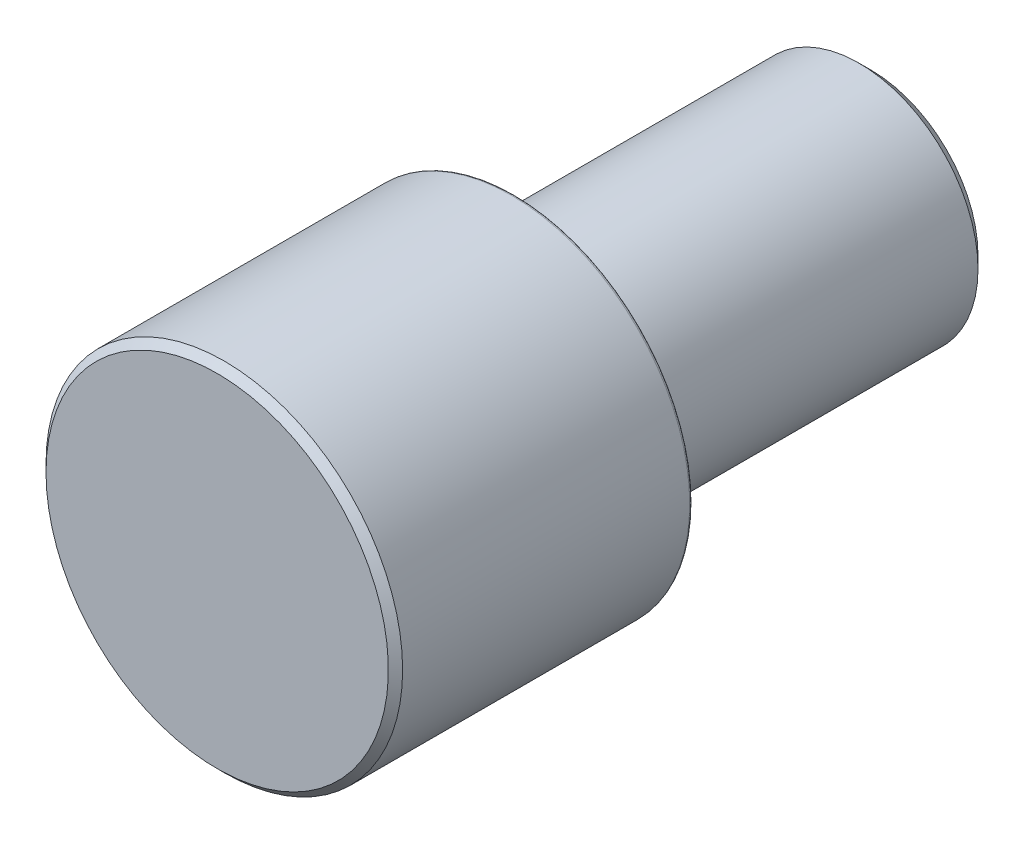
ISO-10303-21;
HEADER;
FILE_DESCRIPTION(('STEP AP214'),'2;1');
FILE_NAME('part.step','',(''),(''),'','','');
FILE_SCHEMA(('AUTOMOTIVE_DESIGN { 1 0 10303 214 1 1 1 1 }'));
ENDSEC;
DATA;
#1=APPLICATION_CONTEXT('core data for automotive mechanical design processes');
#2=APPLICATION_PROTOCOL_DEFINITION('international standard','automotive_design',2000,#1);
#3=PRODUCT_CONTEXT('',#1,'mechanical');
#4=PRODUCT('Part','Part','',(#3));
#5=PRODUCT_RELATED_PRODUCT_CATEGORY('part','',(#4));
#6=PRODUCT_DEFINITION_FORMATION('','',#4);
#7=PRODUCT_DEFINITION_CONTEXT('part definition',#1,'design');
#8=PRODUCT_DEFINITION('design','',#6,#7);
#9=PRODUCT_DEFINITION_SHAPE('','',#8);
#10=(LENGTH_UNIT() NAMED_UNIT(*) SI_UNIT(.MILLI.,.METRE.));
#11=(NAMED_UNIT(*) PLANE_ANGLE_UNIT() SI_UNIT($,.RADIAN.));
#12=(NAMED_UNIT(*) SI_UNIT($,.STERADIAN.) SOLID_ANGLE_UNIT());
#13=UNCERTAINTY_MEASURE_WITH_UNIT(LENGTH_MEASURE(1.E-05),#10,'distance_accuracy_value','');
#14=(GEOMETRIC_REPRESENTATION_CONTEXT(3) GLOBAL_UNCERTAINTY_ASSIGNED_CONTEXT((#13)) GLOBAL_UNIT_ASSIGNED_CONTEXT((#10,
#11,#12)) REPRESENTATION_CONTEXT('',''));
#15=CARTESIAN_POINT('',(0.,0.,0.));
#16=DIRECTION('',(0.,0.,1.));
#17=DIRECTION('',(1.,0.,0.));
#18=AXIS2_PLACEMENT_3D('',#15,#16,#17);
#19=CARTESIAN_POINT('',(0.,0.,5.));
#20=DIRECTION('',(0.,0.,-1.));
#21=DIRECTION('',(-1.,0.,0.));
#22=AXIS2_PLACEMENT_3D('',#19,#20,#21);
#23=PLANE('',#22);
#24=CARTESIAN_POINT('',(0.,0.,5.));
#25=DIRECTION('',(0.,0.,-1.));
#26=DIRECTION('',(-1.,0.,0.));
#27=AXIS2_PLACEMENT_3D('',#24,#25,#26);
#28=CIRCLE('',#27,2.88);
#29=CARTESIAN_POINT('',(-2.88,0.,5.));
#30=VERTEX_POINT('',#29);
#31=EDGE_CURVE('E45',#30,#30,#28,.F.);
#32=ORIENTED_EDGE('',*,*,#31,.T.);
#33=EDGE_LOOP('',(#32));
#34=FACE_BOUND('',#33,.T.);
#35=ADVANCED_FACE('F30',(#34),#23,.F.);
#36=CARTESIAN_POINT('',(0.,0.,12.7));
#37=DIRECTION('',(0.,0.,1.));
#38=DIRECTION('',(1.,0.,0.));
#39=AXIS2_PLACEMENT_3D('',#36,#37,#38);
#40=CYLINDRICAL_SURFACE('',#39,3.);
#41=CARTESIAN_POINT('',(0.,0.,4.88));
#42=DIRECTION('',(0.,0.,-1.));
#43=DIRECTION('',(-1.,0.,0.));
#44=AXIS2_PLACEMENT_3D('',#41,#42,#43);
#45=CIRCLE('',#44,3.);
#46=CARTESIAN_POINT('',(-3.,0.,4.88));
#47=VERTEX_POINT('',#46);
#48=EDGE_CURVE('E41',#47,#47,#45,.T.);
#49=ORIENTED_EDGE('',*,*,#48,.T.);
#50=EDGE_LOOP('',(#49));
#51=FACE_BOUND('',#50,.T.);
#52=CARTESIAN_POINT('',(0.,0.,0.0499999999999997));
#53=DIRECTION('',(0.,0.,1.));
#54=DIRECTION('',(1.,0.,0.));
#55=AXIS2_PLACEMENT_3D('',#52,#53,#54);
#56=CIRCLE('',#55,3.);
#57=CARTESIAN_POINT('',(3.,0.,0.0499999999999997));
#58=VERTEX_POINT('',#57);
#59=EDGE_CURVE('E50',#58,#58,#56,.T.);
#60=ORIENTED_EDGE('',*,*,#59,.T.);
#61=EDGE_LOOP('',(#60));
#62=FACE_BOUND('',#61,.T.);
#63=ADVANCED_FACE('F88',(#51,#62),#40,.T.);
#64=CARTESIAN_POINT('',(0.,0.,0.0499999999999998));
#65=DIRECTION('',(0.,0.,1.));
#66=DIRECTION('',(1.,0.,0.));
#67=AXIS2_PLACEMENT_3D('',#64,#65,#66);
#68=TOROIDAL_SURFACE('',#67,2.95,0.0500000000000001);
#69=ORIENTED_EDGE('',*,*,#59,.F.);
#70=EDGE_LOOP('',(#69));
#71=FACE_BOUND('',#70,.T.);
#72=CARTESIAN_POINT('',(0.,0.,0.));
#73=DIRECTION('',(0.,0.,1.));
#74=DIRECTION('',(1.,0.,0.));
#75=AXIS2_PLACEMENT_3D('',#72,#73,#74);
#76=CIRCLE('',#75,2.95);
#77=CARTESIAN_POINT('',(2.95,0.,0.));
#78=VERTEX_POINT('',#77);
#79=EDGE_CURVE('E53',#78,#78,#76,.T.);
#80=ORIENTED_EDGE('',*,*,#79,.T.);
#81=EDGE_LOOP('',(#80));
#82=FACE_BOUND('',#81,.T.);
#83=ADVANCED_FACE('F94',(#71,#82),#68,.T.);
#84=CARTESIAN_POINT('',(0.,2.95,0.));
#85=DIRECTION('',(0.,0.,1.));
#86=DIRECTION('',(1.,0.,0.));
#87=AXIS2_PLACEMENT_3D('',#84,#85,#86);
#88=PLANE('',#87);
#89=ORIENTED_EDGE('',*,*,#79,.F.);
#90=EDGE_LOOP('',(#89));
#91=FACE_BOUND('',#90,.T.);
#92=CARTESIAN_POINT('',(0.,0.,0.));
#93=DIRECTION('',(0.,0.,1.));
#94=DIRECTION('',(1.,0.,0.));
#95=AXIS2_PLACEMENT_3D('',#92,#93,#94);
#96=CIRCLE('',#95,2.19364916731037);
#97=CARTESIAN_POINT('',(2.19364916731037,0.,0.));
#98=VERTEX_POINT('',#97);
#99=EDGE_CURVE('E56',#98,#98,#96,.T.);
#100=ORIENTED_EDGE('',*,*,#99,.T.);
#101=EDGE_LOOP('',(#100));
#102=FACE_BOUND('',#101,.T.);
#103=ADVANCED_FACE('F112',(#91,#102),#88,.F.);
#104=CARTESIAN_POINT('',(0.,0.,0.0499999999999997));
#105=DIRECTION('',(0.,0.,1.));
#106=DIRECTION('',(1.,0.,0.));
#107=AXIS2_PLACEMENT_3D('',#104,#105,#106);
#108=TOROIDAL_SURFACE('',#107,2.19364916731037,0.05);
#109=ORIENTED_EDGE('',*,*,#99,.F.);
#110=EDGE_LOOP('',(#109));
#111=FACE_BOUND('',#110,.T.);
#112=CARTESIAN_POINT('',(0.,0.,0.0374999999999993));
#113=DIRECTION('',(0.,0.,1.));
#114=DIRECTION('',(1.,0.,0.));
#115=AXIS2_PLACEMENT_3D('',#112,#113,#114);
#116=CIRCLE('',#115,2.14523687548278);
#117=CARTESIAN_POINT('',(2.14523687548278,0.,0.0374999999999993));
#118=VERTEX_POINT('',#117);
#119=EDGE_CURVE('E59',#118,#118,#116,.T.);
#120=ORIENTED_EDGE('',*,*,#119,.T.);
#121=EDGE_LOOP('',(#120));
#122=FACE_BOUND('',#121,.T.);
#123=ADVANCED_FACE('F117',(#111,#122),#108,.T.);
#124=CARTESIAN_POINT('',(0.,0.,0.));
#125=DIRECTION('',(0.,0.,1.));
#126=DIRECTION('',(1.,0.,0.));
#127=AXIS2_PLACEMENT_3D('',#124,#125,#126);
#128=TOROIDAL_SURFACE('',#127,2.,0.15);
#129=ORIENTED_EDGE('',*,*,#119,.F.);
#130=EDGE_LOOP('',(#129));
#131=FACE_BOUND('',#130,.T.);
#132=CARTESIAN_POINT('',(0.,0.,0.));
#133=DIRECTION('',(0.,0.,1.));
#134=DIRECTION('',(1.,0.,0.));
#135=AXIS2_PLACEMENT_3D('',#132,#133,#134);
#136=CIRCLE('',#135,1.85);
#137=CARTESIAN_POINT('',(1.85,0.,0.));
#138=VERTEX_POINT('',#137);
#139=EDGE_CURVE('E62',#138,#138,#136,.T.);
#140=ORIENTED_EDGE('',*,*,#139,.T.);
#141=EDGE_LOOP('',(#140));
#142=FACE_BOUND('',#141,.T.);
#143=ADVANCED_FACE('F123',(#131,#142),#128,.F.);
#144=CARTESIAN_POINT('',(0.,0.,12.7));
#145=DIRECTION('',(0.,0.,1.));
#146=DIRECTION('',(1.,0.,0.));
#147=AXIS2_PLACEMENT_3D('',#144,#145,#146);
#148=CYLINDRICAL_SURFACE('',#147,1.85);
#149=ORIENTED_EDGE('',*,*,#139,.F.);
#150=EDGE_LOOP('',(#149));
#151=FACE_BOUND('',#150,.T.);
#152=CARTESIAN_POINT('',(0.,0.,-0.3));
#153=DIRECTION('',(0.,0.,1.));
#154=DIRECTION('',(1.,0.,0.));
#155=AXIS2_PLACEMENT_3D('',#152,#153,#154);
#156=CIRCLE('',#155,1.85);
#157=CARTESIAN_POINT('',(1.85,0.,-0.3));
#158=VERTEX_POINT('',#157);
#159=EDGE_CURVE('E65',#158,#158,#156,.T.);
#160=ORIENTED_EDGE('',*,*,#159,.T.);
#161=EDGE_LOOP('',(#160));
#162=FACE_BOUND('',#161,.T.);
#163=ADVANCED_FACE('F84',(#151,#162),#148,.T.);
#164=CARTESIAN_POINT('',(0.,1.85,-0.3));
#165=DIRECTION('',(0.,0.,-1.));
#166=DIRECTION('',(-1.,0.,0.));
#167=AXIS2_PLACEMENT_3D('',#164,#165,#166);
#168=PLANE('',#167);
#169=ORIENTED_EDGE('',*,*,#159,.F.);
#170=EDGE_LOOP('',(#169));
#171=FACE_BOUND('',#170,.T.);
#172=CARTESIAN_POINT('',(0.,0.,-0.3));
#173=DIRECTION('',(0.,0.,1.));
#174=DIRECTION('',(1.,0.,0.));
#175=AXIS2_PLACEMENT_3D('',#172,#173,#174);
#176=CIRCLE('',#175,2.);
#177=CARTESIAN_POINT('',(2.,0.,-0.3));
#178=VERTEX_POINT('',#177);
#179=EDGE_CURVE('E68',#178,#178,#176,.T.);
#180=ORIENTED_EDGE('',*,*,#179,.T.);
#181=EDGE_LOOP('',(#180));
#182=FACE_BOUND('',#181,.T.);
#183=ADVANCED_FACE('F72',(#171,#182),#168,.F.);
#184=CARTESIAN_POINT('',(0.,0.,12.7));
#185=DIRECTION('',(0.,0.,1.));
#186=DIRECTION('',(1.,0.,0.));
#187=AXIS2_PLACEMENT_3D('',#184,#185,#186);
#188=CYLINDRICAL_SURFACE('',#187,2.);
#189=CARTESIAN_POINT('',(0.,0.,-5.8));
#190=DIRECTION('',(0.,0.,1.));
#191=DIRECTION('',(1.,0.,0.));
#192=AXIS2_PLACEMENT_3D('',#189,#190,#191);
#193=CIRCLE('',#192,2.);
#194=CARTESIAN_POINT('',(2.,0.,-5.8));
#195=VERTEX_POINT('',#194);
#196=EDGE_CURVE('E37',#195,#195,#193,.T.);
#197=ORIENTED_EDGE('',*,*,#196,.T.);
#198=EDGE_LOOP('',(#197));
#199=FACE_BOUND('',#198,.T.);
#200=ORIENTED_EDGE('',*,*,#179,.F.);
#201=EDGE_LOOP('',(#200));
#202=FACE_BOUND('',#201,.T.);
#203=ADVANCED_FACE('F74',(#199,#202),#188,.T.);
#204=CARTESIAN_POINT('',(0.,2.,-6.));
#205=DIRECTION('',(0.,0.,1.));
#206=DIRECTION('',(1.,0.,0.));
#207=AXIS2_PLACEMENT_3D('',#204,#205,#206);
#208=PLANE('',#207);
#209=CARTESIAN_POINT('',(0.,0.,-6.));
#210=DIRECTION('',(0.,0.,1.));
#211=DIRECTION('',(1.,0.,0.));
#212=AXIS2_PLACEMENT_3D('',#209,#210,#211);
#213=CIRCLE('',#212,1.8);
#214=CARTESIAN_POINT('',(1.8,0.,-6.));
#215=VERTEX_POINT('',#214);
#216=EDGE_CURVE('E10',#215,#215,#213,.F.);
#217=ORIENTED_EDGE('',*,*,#216,.T.);
#218=EDGE_LOOP('',(#217));
#219=FACE_BOUND('',#218,.T.);
#220=ADVANCED_FACE('F76',(#219),#208,.F.);
#221=CARTESIAN_POINT('',(0.,0.,5.));
#222=DIRECTION('',(0.,0.,-1.));
#223=DIRECTION('',(-1.,0.,0.));
#224=AXIS2_PLACEMENT_3D('',#221,#222,#223);
#225=CONICAL_SURFACE('',#224,2.88,0.785398163397452);
#226=ORIENTED_EDGE('',*,*,#48,.F.);
#227=EDGE_LOOP('',(#226));
#228=FACE_BOUND('',#227,.T.);
#229=ORIENTED_EDGE('',*,*,#31,.F.);
#230=EDGE_LOOP('',(#229));
#231=FACE_BOUND('',#230,.T.);
#232=ADVANCED_FACE('F82',(#228,#231),#225,.T.);
#233=CARTESIAN_POINT('',(0.,0.,-5.8));
#234=DIRECTION('',(0.,0.,1.));
#235=DIRECTION('',(1.,0.,0.));
#236=AXIS2_PLACEMENT_3D('',#233,#234,#235);
#237=CONICAL_SURFACE('',#236,2.,0.785398163397453);
#238=ORIENTED_EDGE('',*,*,#216,.F.);
#239=EDGE_LOOP('',(#238));
#240=FACE_BOUND('',#239,.T.);
#241=ORIENTED_EDGE('',*,*,#196,.F.);
#242=EDGE_LOOP('',(#241));
#243=FACE_BOUND('',#242,.T.);
#244=ADVANCED_FACE('F32',(#240,#243),#237,.T.);
#245=CLOSED_SHELL('',(#35,#63,#83,#103,#123,#143,#163,#183,#203,#220,#232,#244));
#246=MANIFOLD_SOLID_BREP('B2',#245);
#247=ADVANCED_BREP_SHAPE_REPRESENTATION('',(#18,#246),#14);
#248=SHAPE_DEFINITION_REPRESENTATION(#9,#247);
ENDSEC;
END-ISO-10303-21;
